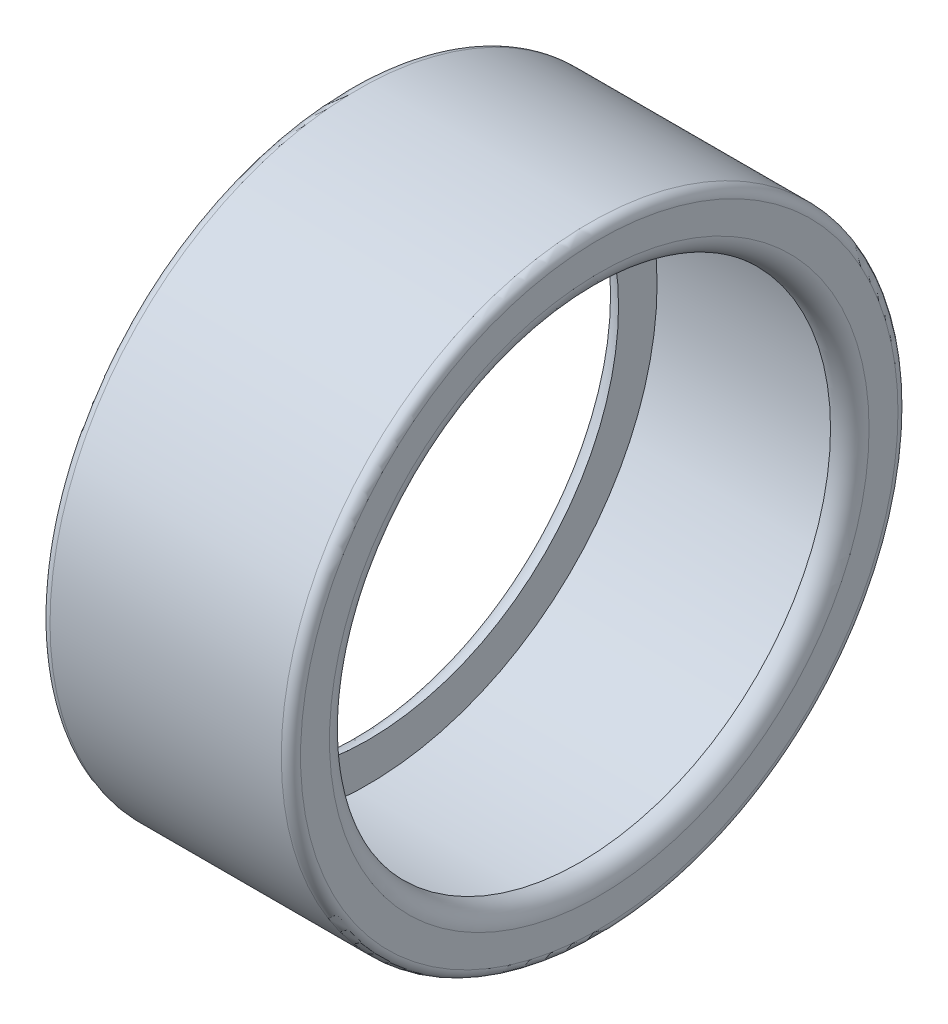
ISO-10303-21;
HEADER;
FILE_DESCRIPTION(('STEP AP214'),'2;1');
FILE_NAME('part.step','',(''),(''),'','','');
FILE_SCHEMA(('AUTOMOTIVE_DESIGN { 1 0 10303 214 1 1 1 1 }'));
ENDSEC;
DATA;
#1=APPLICATION_CONTEXT('core data for automotive mechanical design processes');
#2=APPLICATION_PROTOCOL_DEFINITION('international standard','automotive_design',2000,#1);
#3=PRODUCT_CONTEXT('',#1,'mechanical');
#4=PRODUCT('Part','Part','',(#3));
#5=PRODUCT_RELATED_PRODUCT_CATEGORY('part','',(#4));
#6=PRODUCT_DEFINITION_FORMATION('','',#4);
#7=PRODUCT_DEFINITION_CONTEXT('part definition',#1,'design');
#8=PRODUCT_DEFINITION('design','',#6,#7);
#9=PRODUCT_DEFINITION_SHAPE('','',#8);
#10=(LENGTH_UNIT() NAMED_UNIT(*) SI_UNIT(.MILLI.,.METRE.));
#11=(NAMED_UNIT(*) PLANE_ANGLE_UNIT() SI_UNIT($,.RADIAN.));
#12=(NAMED_UNIT(*) SI_UNIT($,.STERADIAN.) SOLID_ANGLE_UNIT());
#13=UNCERTAINTY_MEASURE_WITH_UNIT(LENGTH_MEASURE(1.E-05),#10,'distance_accuracy_value','');
#14=(GEOMETRIC_REPRESENTATION_CONTEXT(3) GLOBAL_UNCERTAINTY_ASSIGNED_CONTEXT((#13)) GLOBAL_UNIT_ASSIGNED_CONTEXT((#10,
#11,#12)) REPRESENTATION_CONTEXT('',''));
#15=CARTESIAN_POINT('',(0.,0.,0.));
#16=DIRECTION('',(0.,0.,1.));
#17=DIRECTION('',(1.,0.,0.));
#18=AXIS2_PLACEMENT_3D('',#15,#16,#17);
#19=CARTESIAN_POINT('',(26.,0.,0.));
#20=DIRECTION('',(1.,0.,0.));
#21=DIRECTION('',(0.,0.,-1.));
#22=AXIS2_PLACEMENT_3D('',#19,#20,#21);
#23=PLANE('',#22);
#24=CARTESIAN_POINT('',(26.,0.,0.));
#25=DIRECTION('',(1.,0.,0.));
#26=DIRECTION('',(0.,0.,-1.));
#27=AXIS2_PLACEMENT_3D('',#24,#25,#26);
#28=CIRCLE('',#27,28.);
#29=CARTESIAN_POINT('',(26.,0.,-28.));
#30=VERTEX_POINT('',#29);
#31=EDGE_CURVE('E40',#30,#30,#28,.F.);
#32=ORIENTED_EDGE('',*,*,#31,.T.);
#33=EDGE_LOOP('',(#32));
#34=FACE_BOUND('',#33,.T.);
#35=CARTESIAN_POINT('',(26.,0.,0.));
#36=DIRECTION('',(1.,0.,0.));
#37=DIRECTION('',(0.,0.,-1.));
#38=AXIS2_PLACEMENT_3D('',#35,#36,#37);
#39=CIRCLE('',#38,31.);
#40=CARTESIAN_POINT('',(26.,0.,-31.));
#41=VERTEX_POINT('',#40);
#42=EDGE_CURVE('E44',#41,#41,#39,.T.);
#43=ORIENTED_EDGE('',*,*,#42,.T.);
#44=EDGE_LOOP('',(#43));
#45=FACE_BOUND('',#44,.T.);
#46=ADVANCED_FACE('F33',(#34,#45),#23,.T.);
#47=CARTESIAN_POINT('',(0.,0.,0.));
#48=DIRECTION('',(1.,0.,0.));
#49=DIRECTION('',(0.,0.,-1.));
#50=AXIS2_PLACEMENT_3D('',#47,#48,#49);
#51=PLANE('',#50);
#52=CARTESIAN_POINT('',(0.,0.,0.));
#53=DIRECTION('',(1.,0.,0.));
#54=DIRECTION('',(0.,0.,-1.));
#55=AXIS2_PLACEMENT_3D('',#52,#53,#54);
#56=CIRCLE('',#55,28.);
#57=CARTESIAN_POINT('',(0.,0.,-28.));
#58=VERTEX_POINT('',#57);
#59=EDGE_CURVE('E10',#58,#58,#56,.T.);
#60=ORIENTED_EDGE('',*,*,#59,.T.);
#61=EDGE_LOOP('',(#60));
#62=FACE_BOUND('',#61,.T.);
#63=CARTESIAN_POINT('',(0.,0.,0.));
#64=DIRECTION('',(1.,0.,0.));
#65=DIRECTION('',(0.,0.,-1.));
#66=AXIS2_PLACEMENT_3D('',#63,#64,#65);
#67=CIRCLE('',#66,31.);
#68=CARTESIAN_POINT('',(0.,0.,-31.));
#69=VERTEX_POINT('',#68);
#70=EDGE_CURVE('E48',#69,#69,#67,.F.);
#71=ORIENTED_EDGE('',*,*,#70,.T.);
#72=EDGE_LOOP('',(#71));
#73=FACE_BOUND('',#72,.T.);
#74=ADVANCED_FACE('F88',(#62,#73),#51,.F.);
#75=CARTESIAN_POINT('',(26.,0.,0.));
#76=DIRECTION('',(-1.,0.,0.));
#77=DIRECTION('',(0.,0.,1.));
#78=AXIS2_PLACEMENT_3D('',#75,#76,#77);
#79=CYLINDRICAL_SURFACE('',#78,32.);
#80=CARTESIAN_POINT('',(1.,0.,0.));
#81=DIRECTION('',(1.,0.,0.));
#82=DIRECTION('',(0.,0.,-1.));
#83=AXIS2_PLACEMENT_3D('',#80,#81,#82);
#84=CIRCLE('',#83,32.);
#85=CARTESIAN_POINT('',(1.,0.,32.));
#86=VERTEX_POINT('',#85);
#87=EDGE_CURVE('E53',#86,#86,#84,.T.);
#88=CARTESIAN_POINT('',(25.,0.,0.));
#89=DIRECTION('',(1.,0.,0.));
#90=DIRECTION('',(0.,0.,-1.));
#91=AXIS2_PLACEMENT_3D('',#88,#89,#90);
#92=CIRCLE('',#91,32.);
#93=CARTESIAN_POINT('',(25.,0.,32.));
#94=VERTEX_POINT('',#93);
#95=EDGE_CURVE('E56',#94,#94,#92,.F.);
#96=CARTESIAN_POINT('',(1.,0.,32.));
#97=CARTESIAN_POINT('',(1.25,0.,32.));
#98=CARTESIAN_POINT('',(1.5,0.,32.));
#99=CARTESIAN_POINT('',(2.,0.,32.));
#100=CARTESIAN_POINT('',(2.25,0.,32.));
#101=CARTESIAN_POINT('',(2.75,0.,32.));
#102=CARTESIAN_POINT('',(3.,0.,32.));
#103=CARTESIAN_POINT('',(3.5,0.,32.));
#104=CARTESIAN_POINT('',(3.75,0.,32.));
#105=CARTESIAN_POINT('',(4.25,0.,32.));
#106=CARTESIAN_POINT('',(4.5,0.,32.));
#107=CARTESIAN_POINT('',(5.,0.,32.));
#108=CARTESIAN_POINT('',(5.25,0.,32.));
#109=CARTESIAN_POINT('',(5.75,0.,32.));
#110=CARTESIAN_POINT('',(6.,0.,32.));
#111=CARTESIAN_POINT('',(6.5,0.,32.));
#112=CARTESIAN_POINT('',(6.75,0.,32.));
#113=CARTESIAN_POINT('',(7.25,0.,32.));
#114=CARTESIAN_POINT('',(7.5,0.,32.));
#115=CARTESIAN_POINT('',(8.,0.,32.));
#116=CARTESIAN_POINT('',(8.25,0.,32.));
#117=CARTESIAN_POINT('',(8.75,0.,32.));
#118=CARTESIAN_POINT('',(9.,0.,32.));
#119=CARTESIAN_POINT('',(9.5,0.,32.));
#120=CARTESIAN_POINT('',(9.75,0.,32.));
#121=CARTESIAN_POINT('',(10.25,0.,32.));
#122=CARTESIAN_POINT('',(10.5,0.,32.));
#123=CARTESIAN_POINT('',(11.,0.,32.));
#124=CARTESIAN_POINT('',(11.25,0.,32.));
#125=CARTESIAN_POINT('',(11.75,0.,32.));
#126=CARTESIAN_POINT('',(12.,0.,32.));
#127=CARTESIAN_POINT('',(12.5,0.,32.));
#128=CARTESIAN_POINT('',(12.75,0.,32.));
#129=CARTESIAN_POINT('',(13.25,0.,32.));
#130=CARTESIAN_POINT('',(13.5,0.,32.));
#131=CARTESIAN_POINT('',(14.,0.,32.));
#132=CARTESIAN_POINT('',(14.25,0.,32.));
#133=CARTESIAN_POINT('',(14.75,0.,32.));
#134=CARTESIAN_POINT('',(15.,0.,32.));
#135=CARTESIAN_POINT('',(15.5,0.,32.));
#136=CARTESIAN_POINT('',(15.75,0.,32.));
#137=CARTESIAN_POINT('',(16.25,0.,32.));
#138=CARTESIAN_POINT('',(16.5,0.,32.));
#139=CARTESIAN_POINT('',(17.,0.,32.));
#140=CARTESIAN_POINT('',(17.25,0.,32.));
#141=CARTESIAN_POINT('',(17.75,0.,32.));
#142=CARTESIAN_POINT('',(18.,0.,32.));
#143=CARTESIAN_POINT('',(18.5,0.,32.));
#144=CARTESIAN_POINT('',(18.75,0.,32.));
#145=CARTESIAN_POINT('',(19.25,0.,32.));
#146=CARTESIAN_POINT('',(19.5,0.,32.));
#147=CARTESIAN_POINT('',(20.,0.,32.));
#148=CARTESIAN_POINT('',(20.25,0.,32.));
#149=CARTESIAN_POINT('',(20.75,0.,32.));
#150=CARTESIAN_POINT('',(21.,0.,32.));
#151=CARTESIAN_POINT('',(21.5,0.,32.));
#152=CARTESIAN_POINT('',(21.75,0.,32.));
#153=CARTESIAN_POINT('',(22.25,0.,32.));
#154=CARTESIAN_POINT('',(22.5,0.,32.));
#155=CARTESIAN_POINT('',(23.,0.,32.));
#156=CARTESIAN_POINT('',(23.25,0.,32.));
#157=CARTESIAN_POINT('',(23.75,0.,32.));
#158=CARTESIAN_POINT('',(24.,0.,32.));
#159=CARTESIAN_POINT('',(24.5,0.,32.));
#160=CARTESIAN_POINT('',(24.75,0.,32.));
#161=CARTESIAN_POINT('',(25.,0.,32.));
#162=B_SPLINE_CURVE_WITH_KNOTS('',3,(#96,#97,#98,#99,#100,#101,#102,#103,#104,#105,#106,#107,
#108,#109,#110,#111,#112,#113,#114,#115,#116,#117,#118,#119,#120,#121,#122,#123,#124,#125,#126,
#127,#128,#129,#130,#131,#132,#133,#134,#135,#136,#137,#138,#139,#140,#141,#142,#143,#144,#145,
#146,#147,#148,#149,#150,#151,#152,#153,#154,#155,#156,#157,#158,#159,#160,#161),.UNSPECIFIED.,
.F.,.F.,(4,2,2,2,2,2,2,2,2,2,2,2,2,2,2,2,2,2,2,2,2,2,2,2,2,2,2,2,2,2,2,2,4),(0.,
0.750000000000001,1.5,2.25,3.,3.75,4.5,5.25,6.,6.75,7.5,8.25,9.,9.75,10.5,11.25,12.,12.75,13.5,
14.25,15.,15.75,16.5,17.25,18.,18.75,19.5,20.25,21.,21.75,22.5,23.25,24.),.UNSPECIFIED.);
#163=EDGE_CURVE('BSEAM93',#86,#94,#162,.T.);
#164=ORIENTED_EDGE('',*,*,#87,.T.);
#165=ORIENTED_EDGE('',*,*,#95,.T.);
#166=ORIENTED_EDGE('',*,*,#163,.T.);
#167=ORIENTED_EDGE('',*,*,#163,.F.);
#168=EDGE_LOOP('',(#164,#166,#165,#167));
#169=FACE_BOUND('',#168,.T.);
#170=ADVANCED_FACE('F93',(#169),#79,.T.);
#171=CARTESIAN_POINT('',(1.,0.,0.));
#172=DIRECTION('',(1.,0.,0.));
#173=DIRECTION('',(0.,0.,-1.));
#174=AXIS2_PLACEMENT_3D('',#171,#172,#173);
#175=TOROIDAL_SURFACE('',#174,31.,1.);
#176=ORIENTED_EDGE('',*,*,#70,.F.);
#177=EDGE_LOOP('',(#176));
#178=FACE_BOUND('',#177,.T.);
#179=ORIENTED_EDGE('',*,*,#87,.F.);
#180=EDGE_LOOP('',(#179));
#181=FACE_BOUND('',#180,.T.);
#182=ADVANCED_FACE('F100',(#178,#181),#175,.T.);
#183=CARTESIAN_POINT('',(25.,0.,0.));
#184=DIRECTION('',(1.,0.,0.));
#185=DIRECTION('',(0.,0.,-1.));
#186=AXIS2_PLACEMENT_3D('',#183,#184,#185);
#187=TOROIDAL_SURFACE('',#186,31.,1.);
#188=ORIENTED_EDGE('',*,*,#95,.F.);
#189=EDGE_LOOP('',(#188));
#190=FACE_BOUND('',#189,.T.);
#191=ORIENTED_EDGE('',*,*,#42,.F.);
#192=EDGE_LOOP('',(#191));
#193=FACE_BOUND('',#192,.T.);
#194=ADVANCED_FACE('F104',(#190,#193),#187,.T.);
#195=CARTESIAN_POINT('',(24.,0.,0.));
#196=DIRECTION('',(1.,0.,0.));
#197=DIRECTION('',(0.,0.,-1.));
#198=AXIS2_PLACEMENT_3D('',#195,#196,#197);
#199=TOROIDAL_SURFACE('',#198,28.,2.);
#200=ORIENTED_EDGE('',*,*,#31,.F.);
#201=EDGE_LOOP('',(#200));
#202=FACE_BOUND('',#201,.T.);
#203=CARTESIAN_POINT('',(24.,0.,0.));
#204=DIRECTION('',(1.,0.,0.));
#205=DIRECTION('',(0.,0.,-1.));
#206=AXIS2_PLACEMENT_3D('',#203,#204,#205);
#207=CIRCLE('',#206,26.);
#208=CARTESIAN_POINT('',(24.,0.,-26.));
#209=VERTEX_POINT('',#208);
#210=EDGE_CURVE('E59',#209,#209,#207,.T.);
#211=ORIENTED_EDGE('',*,*,#210,.F.);
#212=EDGE_LOOP('',(#211));
#213=FACE_BOUND('',#212,.T.);
#214=ADVANCED_FACE('F85',(#202,#213),#199,.T.);
#215=CARTESIAN_POINT('',(2.,0.,0.));
#216=DIRECTION('',(1.,0.,0.));
#217=DIRECTION('',(0.,0.,-1.));
#218=AXIS2_PLACEMENT_3D('',#215,#216,#217);
#219=TOROIDAL_SURFACE('',#218,28.,2.);
#220=CARTESIAN_POINT('',(2.,0.,0.));
#221=DIRECTION('',(1.,0.,0.));
#222=DIRECTION('',(0.,0.,-1.));
#223=AXIS2_PLACEMENT_3D('',#220,#221,#222);
#224=CIRCLE('',#223,26.);
#225=CARTESIAN_POINT('',(2.,0.,-26.));
#226=VERTEX_POINT('',#225);
#227=EDGE_CURVE('E60',#226,#226,#224,.T.);
#228=ORIENTED_EDGE('',*,*,#227,.T.);
#229=EDGE_LOOP('',(#228));
#230=FACE_BOUND('',#229,.T.);
#231=ORIENTED_EDGE('',*,*,#59,.F.);
#232=EDGE_LOOP('',(#231));
#233=FACE_BOUND('',#232,.T.);
#234=ADVANCED_FACE('F35',(#230,#233),#219,.T.);
#235=CARTESIAN_POINT('',(24.,0.,0.));
#236=DIRECTION('',(1.,0.,0.));
#237=DIRECTION('',(0.,0.,-1.));
#238=AXIS2_PLACEMENT_3D('',#235,#236,#237);
#239=PLANE('',#238);
#240=ORIENTED_EDGE('',*,*,#210,.T.);
#241=EDGE_LOOP('',(#240));
#242=FACE_BOUND('',#241,.T.);
#243=CARTESIAN_POINT('',(24.,0.,0.));
#244=DIRECTION('',(1.,0.,0.));
#245=DIRECTION('',(0.,0.,-1.));
#246=AXIS2_PLACEMENT_3D('',#243,#244,#245);
#247=CIRCLE('',#246,30.);
#248=CARTESIAN_POINT('',(24.,0.,30.));
#249=VERTEX_POINT('',#248);
#250=EDGE_CURVE('E63',#249,#249,#247,.T.);
#251=ORIENTED_EDGE('',*,*,#250,.F.);
#252=EDGE_LOOP('',(#251));
#253=FACE_BOUND('',#252,.T.);
#254=ADVANCED_FACE('F74',(#242,#253),#239,.F.);
#255=CARTESIAN_POINT('',(2.,0.,0.));
#256=DIRECTION('',(1.,0.,0.));
#257=DIRECTION('',(0.,0.,-1.));
#258=AXIS2_PLACEMENT_3D('',#255,#256,#257);
#259=PLANE('',#258);
#260=ORIENTED_EDGE('',*,*,#227,.F.);
#261=EDGE_LOOP('',(#260));
#262=FACE_BOUND('',#261,.T.);
#263=CARTESIAN_POINT('',(2.,0.,0.));
#264=DIRECTION('',(1.,0.,0.));
#265=DIRECTION('',(0.,0.,-1.));
#266=AXIS2_PLACEMENT_3D('',#263,#264,#265);
#267=CIRCLE('',#266,30.);
#268=CARTESIAN_POINT('',(1.99999999999999,0.,30.));
#269=VERTEX_POINT('',#268);
#270=EDGE_CURVE('E66',#269,#269,#267,.T.);
#271=ORIENTED_EDGE('',*,*,#270,.T.);
#272=EDGE_LOOP('',(#271));
#273=FACE_BOUND('',#272,.T.);
#274=ADVANCED_FACE('F76',(#262,#273),#259,.T.);
#275=CARTESIAN_POINT('',(26.,0.,0.));
#276=DIRECTION('',(-1.,0.,0.));
#277=DIRECTION('',(0.,0.,1.));
#278=AXIS2_PLACEMENT_3D('',#275,#276,#277);
#279=CYLINDRICAL_SURFACE('',#278,30.);
#280=CARTESIAN_POINT('',(1.99999999999999,0.,30.));
#281=CARTESIAN_POINT('',(2.22916666666666,0.,30.));
#282=CARTESIAN_POINT('',(2.45833333333333,0.,30.));
#283=CARTESIAN_POINT('',(2.91666666666666,0.,30.));
#284=CARTESIAN_POINT('',(3.14583333333333,0.,30.));
#285=CARTESIAN_POINT('',(3.60416666666666,0.,30.));
#286=CARTESIAN_POINT('',(3.83333333333333,0.,30.));
#287=CARTESIAN_POINT('',(4.29166666666666,0.,30.));
#288=CARTESIAN_POINT('',(4.52083333333333,0.,30.));
#289=CARTESIAN_POINT('',(4.97916666666666,0.,30.));
#290=CARTESIAN_POINT('',(5.20833333333333,0.,30.));
#291=CARTESIAN_POINT('',(5.66666666666666,0.,30.));
#292=CARTESIAN_POINT('',(5.89583333333333,0.,30.));
#293=CARTESIAN_POINT('',(6.35416666666666,0.,30.));
#294=CARTESIAN_POINT('',(6.58333333333333,0.,30.));
#295=CARTESIAN_POINT('',(7.04166666666666,0.,30.));
#296=CARTESIAN_POINT('',(7.27083333333333,0.,30.));
#297=CARTESIAN_POINT('',(7.72916666666666,0.,30.));
#298=CARTESIAN_POINT('',(7.95833333333333,0.,30.));
#299=CARTESIAN_POINT('',(8.41666666666666,0.,30.));
#300=CARTESIAN_POINT('',(8.64583333333333,0.,30.));
#301=CARTESIAN_POINT('',(9.10416666666666,0.,30.));
#302=CARTESIAN_POINT('',(9.33333333333333,0.,30.));
#303=CARTESIAN_POINT('',(9.79166666666666,0.,30.));
#304=CARTESIAN_POINT('',(10.0208333333333,0.,30.));
#305=CARTESIAN_POINT('',(10.4791666666667,0.,30.));
#306=CARTESIAN_POINT('',(10.7083333333333,0.,30.));
#307=CARTESIAN_POINT('',(11.1666666666667,0.,30.));
#308=CARTESIAN_POINT('',(11.3958333333333,0.,30.));
#309=CARTESIAN_POINT('',(11.8541666666667,0.,30.));
#310=CARTESIAN_POINT('',(12.0833333333333,0.,30.));
#311=CARTESIAN_POINT('',(12.5416666666667,0.,30.));
#312=CARTESIAN_POINT('',(12.7708333333333,0.,30.));
#313=CARTESIAN_POINT('',(13.2291666666667,0.,30.));
#314=CARTESIAN_POINT('',(13.4583333333333,0.,30.));
#315=CARTESIAN_POINT('',(13.9166666666667,0.,30.));
#316=CARTESIAN_POINT('',(14.1458333333333,0.,30.));
#317=CARTESIAN_POINT('',(14.6041666666667,0.,30.));
#318=CARTESIAN_POINT('',(14.8333333333333,0.,30.));
#319=CARTESIAN_POINT('',(15.2916666666667,0.,30.));
#320=CARTESIAN_POINT('',(15.5208333333333,0.,30.));
#321=CARTESIAN_POINT('',(15.9791666666667,0.,30.));
#322=CARTESIAN_POINT('',(16.2083333333333,0.,30.));
#323=CARTESIAN_POINT('',(16.6666666666667,0.,30.));
#324=CARTESIAN_POINT('',(16.8958333333333,0.,30.));
#325=CARTESIAN_POINT('',(17.3541666666667,0.,30.));
#326=CARTESIAN_POINT('',(17.5833333333333,0.,30.));
#327=CARTESIAN_POINT('',(18.0416666666667,0.,30.));
#328=CARTESIAN_POINT('',(18.2708333333333,0.,30.));
#329=CARTESIAN_POINT('',(18.7291666666667,0.,30.));
#330=CARTESIAN_POINT('',(18.9583333333333,0.,30.));
#331=CARTESIAN_POINT('',(19.4166666666667,0.,30.));
#332=CARTESIAN_POINT('',(19.6458333333333,0.,30.));
#333=CARTESIAN_POINT('',(20.1041666666667,0.,30.));
#334=CARTESIAN_POINT('',(20.3333333333333,0.,30.));
#335=CARTESIAN_POINT('',(20.7916666666667,0.,30.));
#336=CARTESIAN_POINT('',(21.0208333333333,0.,30.));
#337=CARTESIAN_POINT('',(21.4791666666667,0.,30.));
#338=CARTESIAN_POINT('',(21.7083333333333,0.,30.));
#339=CARTESIAN_POINT('',(22.1666666666667,0.,30.));
#340=CARTESIAN_POINT('',(22.3958333333333,0.,30.));
#341=CARTESIAN_POINT('',(22.8541666666667,0.,30.));
#342=CARTESIAN_POINT('',(23.0833333333333,0.,30.));
#343=CARTESIAN_POINT('',(23.5416666666667,0.,30.));
#344=CARTESIAN_POINT('',(23.7708333333333,0.,30.));
#345=CARTESIAN_POINT('',(24.,0.,30.));
#346=B_SPLINE_CURVE_WITH_KNOTS('',3,(#280,#281,#282,#283,#284,#285,#286,#287,#288,#289,#290,
#291,#292,#293,#294,#295,#296,#297,#298,#299,#300,#301,#302,#303,#304,#305,#306,#307,#308,#309,
#310,#311,#312,#313,#314,#315,#316,#317,#318,#319,#320,#321,#322,#323,#324,#325,#326,#327,#328,
#329,#330,#331,#332,#333,#334,#335,#336,#337,#338,#339,#340,#341,#342,#343,#344,#345),
.UNSPECIFIED.,.F.,.F.,(4,2,2,2,2,2,2,2,2,2,2,2,2,2,2,2,2,2,2,2,2,2,2,2,2,2,2,2,2,2,2,2,4),(0.,
0.687500000000001,1.375,2.0625,2.75,3.4375,4.125,4.8125,5.5,6.1875,6.875,7.5625,8.25,8.9375,
9.625,10.3125,11.,11.6875,12.375,13.0625,13.75,14.4375,15.125,15.8125,16.5,17.1875,17.875,
18.5625,19.25,19.9375,20.625,21.3125,22.),.UNSPECIFIED.);
#347=EDGE_CURVE('BSEAM72',#269,#249,#346,.T.);
#348=ORIENTED_EDGE('',*,*,#270,.F.);
#349=ORIENTED_EDGE('',*,*,#250,.T.);
#350=ORIENTED_EDGE('',*,*,#347,.T.);
#351=ORIENTED_EDGE('',*,*,#347,.F.);
#352=EDGE_LOOP('',(#348,#350,#349,#351));
#353=FACE_BOUND('',#352,.T.);
#354=ADVANCED_FACE('F72',(#353),#279,.F.);
#355=CLOSED_SHELL('',(#46,#74,#170,#182,#194,#214,#234,#254,#274,#354));
#356=MANIFOLD_SOLID_BREP('B2',#355);
#357=ADVANCED_BREP_SHAPE_REPRESENTATION('',(#18,#356),#14);
#358=SHAPE_DEFINITION_REPRESENTATION(#9,#357);
ENDSEC;
END-ISO-10303-21;
